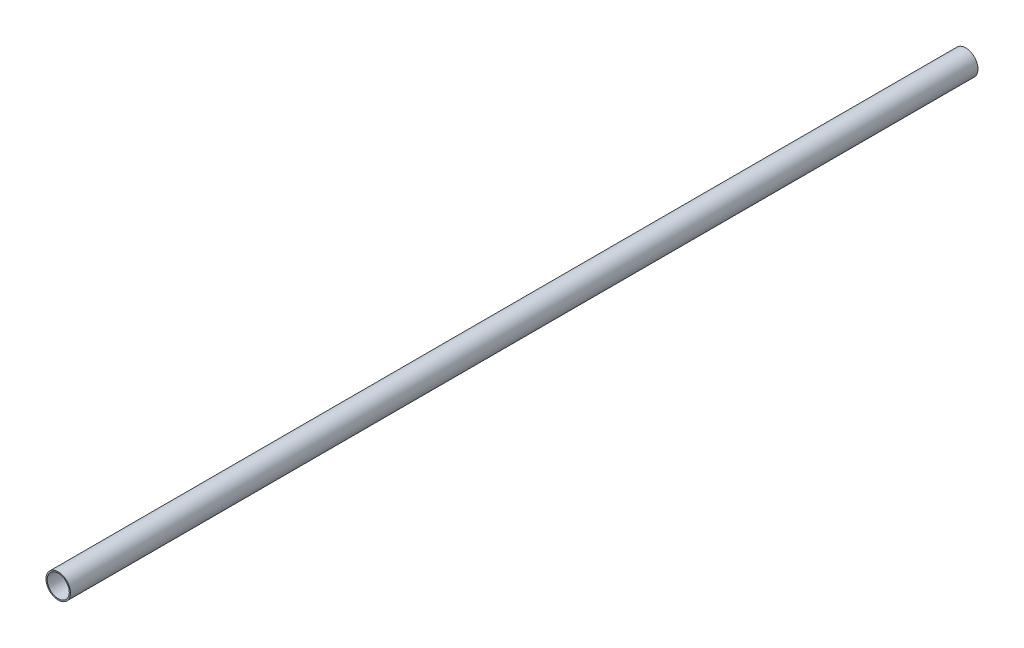
ISO-10303-21;
HEADER;
FILE_DESCRIPTION(('STEP AP214'),'2;1');
FILE_NAME('part.step','',(''),(''),'','','');
FILE_SCHEMA(('AUTOMOTIVE_DESIGN { 1 0 10303 214 1 1 1 1 }'));
ENDSEC;
DATA;
#1=APPLICATION_CONTEXT('core data for automotive mechanical design processes');
#2=APPLICATION_PROTOCOL_DEFINITION('international standard','automotive_design',2000,#1);
#3=PRODUCT_CONTEXT('',#1,'mechanical');
#4=PRODUCT('Part','Part','',(#3));
#5=PRODUCT_RELATED_PRODUCT_CATEGORY('part','',(#4));
#6=PRODUCT_DEFINITION_FORMATION('','',#4);
#7=PRODUCT_DEFINITION_CONTEXT('part definition',#1,'design');
#8=PRODUCT_DEFINITION('design','',#6,#7);
#9=PRODUCT_DEFINITION_SHAPE('','',#8);
#10=(LENGTH_UNIT() NAMED_UNIT(*) SI_UNIT(.MILLI.,.METRE.));
#11=(NAMED_UNIT(*) PLANE_ANGLE_UNIT() SI_UNIT($,.RADIAN.));
#12=(NAMED_UNIT(*) SI_UNIT($,.STERADIAN.) SOLID_ANGLE_UNIT());
#13=UNCERTAINTY_MEASURE_WITH_UNIT(LENGTH_MEASURE(1.E-05),#10,'distance_accuracy_value','');
#14=(GEOMETRIC_REPRESENTATION_CONTEXT(3) GLOBAL_UNCERTAINTY_ASSIGNED_CONTEXT((#13)) GLOBAL_UNIT_ASSIGNED_CONTEXT((#10,
#11,#12)) REPRESENTATION_CONTEXT('',''));
#15=CARTESIAN_POINT('',(0.,0.,0.));
#16=DIRECTION('',(0.,0.,1.));
#17=DIRECTION('',(1.,0.,0.));
#18=AXIS2_PLACEMENT_3D('',#15,#16,#17);
#19=CARTESIAN_POINT('',(0.,0.,185.));
#20=DIRECTION('',(0.,0.,1.));
#21=DIRECTION('',(1.,0.,0.));
#22=AXIS2_PLACEMENT_3D('',#19,#20,#21);
#23=PLANE('',#22);
#24=CARTESIAN_POINT('',(0.,0.,185.));
#25=DIRECTION('',(0.,0.,1.));
#26=DIRECTION('',(1.,0.,0.));
#27=AXIS2_PLACEMENT_3D('',#24,#25,#26);
#28=CIRCLE('',#27,5.);
#29=CARTESIAN_POINT('',(5.,0.,185.));
#30=VERTEX_POINT('',#29);
#31=EDGE_CURVE('E10',#30,#30,#28,.T.);
#32=ORIENTED_EDGE('',*,*,#31,.T.);
#33=EDGE_LOOP('',(#32));
#34=FACE_BOUND('',#33,.T.);
#35=CARTESIAN_POINT('',(0.,0.,185.));
#36=DIRECTION('',(0.,0.,1.));
#37=DIRECTION('',(1.,0.,0.));
#38=AXIS2_PLACEMENT_3D('',#35,#36,#37);
#39=CIRCLE('',#38,4.5);
#40=CARTESIAN_POINT('',(4.5,0.,185.));
#41=VERTEX_POINT('',#40);
#42=EDGE_CURVE('E50',#41,#41,#39,.T.);
#43=ORIENTED_EDGE('',*,*,#42,.F.);
#44=EDGE_LOOP('',(#43));
#45=FACE_BOUND('',#44,.T.);
#46=ADVANCED_FACE('F37',(#34,#45),#23,.T.);
#47=CARTESIAN_POINT('',(0.,0.,-185.));
#48=DIRECTION('',(0.,0.,1.));
#49=DIRECTION('',(1.,0.,0.));
#50=AXIS2_PLACEMENT_3D('',#47,#48,#49);
#51=PLANE('',#50);
#52=CARTESIAN_POINT('',(0.,0.,-185.));
#53=DIRECTION('',(0.,0.,1.));
#54=DIRECTION('',(1.,0.,0.));
#55=AXIS2_PLACEMENT_3D('',#52,#53,#54);
#56=CIRCLE('',#55,5.);
#57=CARTESIAN_POINT('',(5.,0.,-185.));
#58=VERTEX_POINT('',#57);
#59=EDGE_CURVE('E41',#58,#58,#56,.T.);
#60=ORIENTED_EDGE('',*,*,#59,.F.);
#61=EDGE_LOOP('',(#60));
#62=FACE_BOUND('',#61,.T.);
#63=CARTESIAN_POINT('',(0.,0.,-185.));
#64=DIRECTION('',(0.,0.,1.));
#65=DIRECTION('',(1.,0.,0.));
#66=AXIS2_PLACEMENT_3D('',#63,#64,#65);
#67=CIRCLE('',#66,4.5);
#68=CARTESIAN_POINT('',(4.5,0.,-185.));
#69=VERTEX_POINT('',#68);
#70=EDGE_CURVE('E52',#69,#69,#67,.T.);
#71=ORIENTED_EDGE('',*,*,#70,.T.);
#72=EDGE_LOOP('',(#71));
#73=FACE_BOUND('',#72,.T.);
#74=ADVANCED_FACE('F64',(#62,#73),#51,.F.);
#75=CARTESIAN_POINT('',(0.,0.,185.));
#76=DIRECTION('',(0.,0.,-1.));
#77=DIRECTION('',(-1.,0.,0.));
#78=AXIS2_PLACEMENT_3D('',#75,#76,#77);
#79=CYLINDRICAL_SURFACE('',#78,5.);
#80=ORIENTED_EDGE('',*,*,#31,.F.);
#81=EDGE_LOOP('',(#80));
#82=FACE_BOUND('',#81,.T.);
#83=ORIENTED_EDGE('',*,*,#59,.T.);
#84=EDGE_LOOP('',(#83));
#85=FACE_BOUND('',#84,.T.);
#86=ADVANCED_FACE('F39',(#82,#85),#79,.T.);
#87=CARTESIAN_POINT('',(0.,0.,185.));
#88=DIRECTION('',(0.,0.,-1.));
#89=DIRECTION('',(-1.,0.,0.));
#90=AXIS2_PLACEMENT_3D('',#87,#88,#89);
#91=CYLINDRICAL_SURFACE('',#90,4.5);
#92=ORIENTED_EDGE('',*,*,#42,.T.);
#93=EDGE_LOOP('',(#92));
#94=FACE_BOUND('',#93,.T.);
#95=ORIENTED_EDGE('',*,*,#70,.F.);
#96=EDGE_LOOP('',(#95));
#97=FACE_BOUND('',#96,.T.);
#98=ADVANCED_FACE('F60',(#94,#97),#91,.F.);
#99=CLOSED_SHELL('',(#46,#74,#86,#98));
#100=MANIFOLD_SOLID_BREP('B2',#99);
#101=ADVANCED_BREP_SHAPE_REPRESENTATION('',(#18,#100),#14);
#102=SHAPE_DEFINITION_REPRESENTATION(#9,#101);
ENDSEC;
END-ISO-10303-21;
